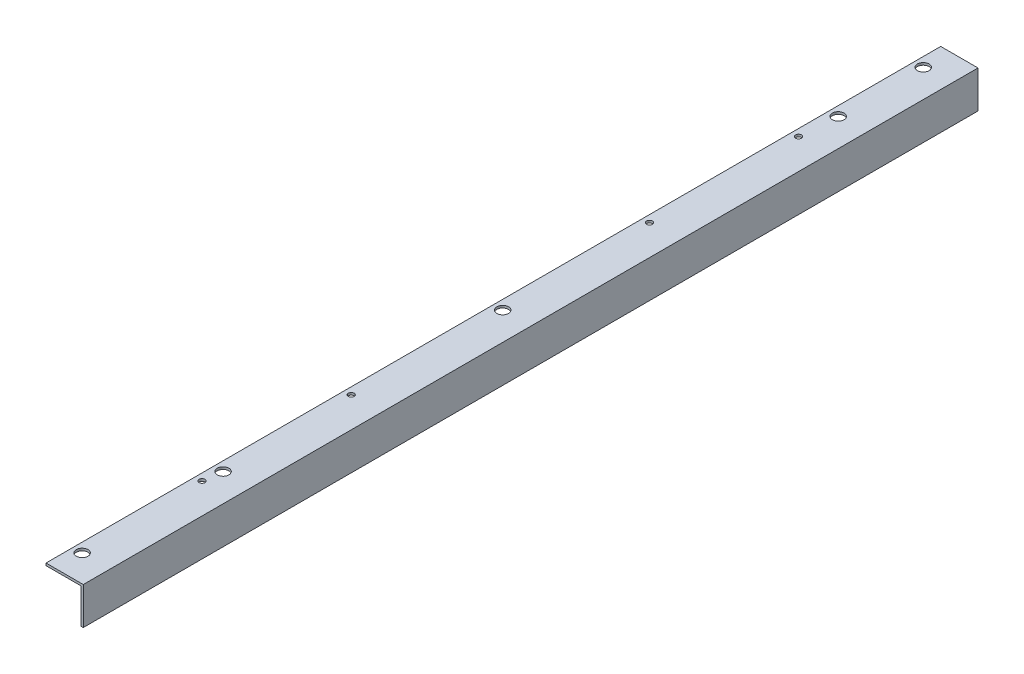
ISO-10303-21;
HEADER;
FILE_DESCRIPTION(('STEP AP214'),'2;1');
FILE_NAME('part.step','',(''),(''),'','','');
FILE_SCHEMA(('AUTOMOTIVE_DESIGN { 1 0 10303 214 1 1 1 1 }'));
ENDSEC;
DATA;
#1=APPLICATION_CONTEXT('core data for automotive mechanical design processes');
#2=APPLICATION_PROTOCOL_DEFINITION('international standard','automotive_design',2000,#1);
#3=PRODUCT_CONTEXT('',#1,'mechanical');
#4=PRODUCT('Part','Part','',(#3));
#5=PRODUCT_RELATED_PRODUCT_CATEGORY('part','',(#4));
#6=PRODUCT_DEFINITION_FORMATION('','',#4);
#7=PRODUCT_DEFINITION_CONTEXT('part definition',#1,'design');
#8=PRODUCT_DEFINITION('design','',#6,#7);
#9=PRODUCT_DEFINITION_SHAPE('','',#8);
#10=(LENGTH_UNIT() NAMED_UNIT(*) SI_UNIT(.MILLI.,.METRE.));
#11=(NAMED_UNIT(*) PLANE_ANGLE_UNIT() SI_UNIT($,.RADIAN.));
#12=(NAMED_UNIT(*) SI_UNIT($,.STERADIAN.) SOLID_ANGLE_UNIT());
#13=UNCERTAINTY_MEASURE_WITH_UNIT(LENGTH_MEASURE(1.E-05),#10,'distance_accuracy_value','');
#14=(GEOMETRIC_REPRESENTATION_CONTEXT(3) GLOBAL_UNCERTAINTY_ASSIGNED_CONTEXT((#13)) GLOBAL_UNIT_ASSIGNED_CONTEXT((#10,
#11,#12)) REPRESENTATION_CONTEXT('',''));
#15=CARTESIAN_POINT('',(0.,0.,0.));
#16=DIRECTION('',(0.,0.,1.));
#17=DIRECTION('',(1.,0.,0.));
#18=AXIS2_PLACEMENT_3D('',#15,#16,#17);
#19=CARTESIAN_POINT('',(0.,-50.8,1219.2));
#20=DIRECTION('',(-1.,0.,0.));
#21=DIRECTION('',(0.,0.,1.));
#22=AXIS2_PLACEMENT_3D('',#19,#20,#21);
#23=PLANE('',#22);
#24=DIRECTION('',(0.,1.,0.));
#25=VECTOR('',#24,1.);
#26=CARTESIAN_POINT('',(0.,-50.8,0.));
#27=LINE('',#26,#25);
#28=CARTESIAN_POINT('',(0.,-50.8,0.));
#29=VERTEX_POINT('',#28);
#30=CARTESIAN_POINT('',(0.,0.,0.));
#31=VERTEX_POINT('',#30);
#32=EDGE_CURVE('E118',#29,#31,#27,.T.);
#33=ORIENTED_EDGE('',*,*,#32,.T.);
#34=DIRECTION('',(0.,0.,-1.));
#35=VECTOR('',#34,1.);
#36=CARTESIAN_POINT('',(0.,0.,1219.2));
#37=LINE('',#36,#35);
#38=CARTESIAN_POINT('',(0.,0.,1219.2));
#39=VERTEX_POINT('',#38);
#40=EDGE_CURVE('E11',#39,#31,#37,.T.);
#41=ORIENTED_EDGE('',*,*,#40,.F.);
#42=DIRECTION('',(0.,1.,0.));
#43=VECTOR('',#42,1.);
#44=CARTESIAN_POINT('',(0.,-50.8,1219.2));
#45=LINE('',#44,#43);
#46=CARTESIAN_POINT('',(0.,-50.8,1219.2));
#47=VERTEX_POINT('',#46);
#48=EDGE_CURVE('E129',#47,#39,#45,.T.);
#49=ORIENTED_EDGE('',*,*,#48,.F.);
#50=DIRECTION('',(0.,0.,-1.));
#51=VECTOR('',#50,1.);
#52=CARTESIAN_POINT('',(0.,-50.8,1219.2));
#53=LINE('',#52,#51);
#54=EDGE_CURVE('E114',#47,#29,#53,.T.);
#55=ORIENTED_EDGE('',*,*,#54,.T.);
#56=EDGE_LOOP('',(#33,#41,#49,#55));
#57=FACE_BOUND('',#56,.T.);
#58=ADVANCED_FACE('F32',(#57),#23,.F.);
#59=CARTESIAN_POINT('',(0.,0.,1219.2));
#60=DIRECTION('',(0.,-1.,0.));
#61=DIRECTION('',(0.,0.,-1.));
#62=AXIS2_PLACEMENT_3D('',#59,#60,#61);
#63=PLANE('',#62);
#64=CARTESIAN_POINT('',(-41.275,0.,406.4));
#65=DIRECTION('',(0.,1.,0.));
#66=DIRECTION('',(0.,0.,1.));
#67=AXIS2_PLACEMENT_3D('',#64,#65,#66);
#68=CIRCLE('',#67,3.96874999999997);
#69=CARTESIAN_POINT('',(-41.275,0.,410.36875));
#70=VERTEX_POINT('',#69);
#71=EDGE_CURVE('E158',#70,#70,#68,.T.);
#72=ORIENTED_EDGE('',*,*,#71,.F.);
#73=EDGE_LOOP('',(#72));
#74=FACE_BOUND('',#73,.T.);
#75=CARTESIAN_POINT('',(-41.275,0.,812.8));
#76=DIRECTION('',(0.,1.,0.));
#77=DIRECTION('',(0.,0.,1.));
#78=AXIS2_PLACEMENT_3D('',#75,#76,#77);
#79=CIRCLE('',#78,3.96874999999997);
#80=CARTESIAN_POINT('',(-41.275,0.,816.76875));
#81=VERTEX_POINT('',#80);
#82=EDGE_CURVE('E279',#81,#81,#79,.T.);
#83=ORIENTED_EDGE('',*,*,#82,.F.);
#84=EDGE_LOOP('',(#83));
#85=FACE_BOUND('',#84,.T.);
#86=CARTESIAN_POINT('',(-41.275,0.,1016.));
#87=DIRECTION('',(0.,1.,0.));
#88=DIRECTION('',(0.,0.,1.));
#89=AXIS2_PLACEMENT_3D('',#86,#87,#88);
#90=CIRCLE('',#89,3.96874999999997);
#91=CARTESIAN_POINT('',(-41.275,0.,1019.96875));
#92=VERTEX_POINT('',#91);
#93=EDGE_CURVE('E171',#92,#92,#90,.T.);
#94=ORIENTED_EDGE('',*,*,#93,.F.);
#95=EDGE_LOOP('',(#94));
#96=FACE_BOUND('',#95,.T.);
#97=CARTESIAN_POINT('',(-41.275,0.,203.2));
#98=DIRECTION('',(0.,1.,0.));
#99=DIRECTION('',(0.,0.,1.));
#100=AXIS2_PLACEMENT_3D('',#97,#98,#99);
#101=CIRCLE('',#100,3.96874999999997);
#102=CARTESIAN_POINT('',(-41.275,0.,207.16875));
#103=VERTEX_POINT('',#102);
#104=EDGE_CURVE('E154',#103,#103,#101,.T.);
#105=ORIENTED_EDGE('',*,*,#104,.F.);
#106=EDGE_LOOP('',(#105));
#107=FACE_BOUND('',#106,.T.);
#108=CARTESIAN_POINT('',(-38.1,0.,36.5124999999999));
#109=DIRECTION('',(0.,1.,0.));
#110=DIRECTION('',(0.,0.,1.));
#111=AXIS2_PLACEMENT_3D('',#108,#109,#110);
#112=CIRCLE('',#111,7.9375);
#113=CARTESIAN_POINT('',(-38.1,0.,44.4499999999999));
#114=VERTEX_POINT('',#113);
#115=EDGE_CURVE('E139',#114,#114,#112,.T.);
#116=ORIENTED_EDGE('',*,*,#115,.F.);
#117=EDGE_LOOP('',(#116));
#118=FACE_BOUND('',#117,.T.);
#119=CARTESIAN_POINT('',(-38.1,0.,990.6));
#120=DIRECTION('',(0.,1.,0.));
#121=DIRECTION('',(0.,0.,1.));
#122=AXIS2_PLACEMENT_3D('',#119,#120,#121);
#123=CIRCLE('',#122,7.9375);
#124=CARTESIAN_POINT('',(-38.1,0.,998.5375));
#125=VERTEX_POINT('',#124);
#126=EDGE_CURVE('E153',#125,#125,#123,.T.);
#127=ORIENTED_EDGE('',*,*,#126,.F.);
#128=EDGE_LOOP('',(#127));
#129=FACE_BOUND('',#128,.T.);
#130=CARTESIAN_POINT('',(-38.1,0.,609.6));
#131=DIRECTION('',(0.,1.,0.));
#132=DIRECTION('',(0.,0.,1.));
#133=AXIS2_PLACEMENT_3D('',#130,#131,#132);
#134=CIRCLE('',#133,7.93750000000003);
#135=CARTESIAN_POINT('',(-38.1,0.,617.5375));
#136=VERTEX_POINT('',#135);
#137=EDGE_CURVE('E176',#136,#136,#134,.T.);
#138=ORIENTED_EDGE('',*,*,#137,.F.);
#139=EDGE_LOOP('',(#138));
#140=FACE_BOUND('',#139,.T.);
#141=CARTESIAN_POINT('',(-38.1,0.,152.4));
#142=DIRECTION('',(0.,1.,0.));
#143=DIRECTION('',(0.,0.,1.));
#144=AXIS2_PLACEMENT_3D('',#141,#142,#143);
#145=CIRCLE('',#144,7.9375);
#146=CARTESIAN_POINT('',(-38.1,0.,160.3375));
#147=VERTEX_POINT('',#146);
#148=EDGE_CURVE('E179',#147,#147,#145,.T.);
#149=ORIENTED_EDGE('',*,*,#148,.F.);
#150=EDGE_LOOP('',(#149));
#151=FACE_BOUND('',#150,.T.);
#152=CARTESIAN_POINT('',(-38.1,0.,1182.6875));
#153=DIRECTION('',(0.,1.,0.));
#154=DIRECTION('',(0.,0.,1.));
#155=AXIS2_PLACEMENT_3D('',#152,#153,#154);
#156=CIRCLE('',#155,7.93749999999997);
#157=CARTESIAN_POINT('',(-38.1,0.,1190.625));
#158=VERTEX_POINT('',#157);
#159=EDGE_CURVE('E175',#158,#158,#156,.T.);
#160=ORIENTED_EDGE('',*,*,#159,.F.);
#161=EDGE_LOOP('',(#160));
#162=FACE_BOUND('',#161,.T.);
#163=DIRECTION('',(-1.,0.,0.));
#164=VECTOR('',#163,1.);
#165=CARTESIAN_POINT('',(0.,0.,0.));
#166=LINE('',#165,#164);
#167=CARTESIAN_POINT('',(-50.8,0.,0.));
#168=VERTEX_POINT('',#167);
#169=EDGE_CURVE('E121',#31,#168,#166,.T.);
#170=ORIENTED_EDGE('',*,*,#169,.T.);
#171=DIRECTION('',(0.,0.,-1.));
#172=VECTOR('',#171,1.);
#173=CARTESIAN_POINT('',(-50.8,0.,1219.2));
#174=LINE('',#173,#172);
#175=CARTESIAN_POINT('',(-50.8,0.,1219.2));
#176=VERTEX_POINT('',#175);
#177=EDGE_CURVE('E41',#176,#168,#174,.T.);
#178=ORIENTED_EDGE('',*,*,#177,.F.);
#179=DIRECTION('',(-1.,0.,0.));
#180=VECTOR('',#179,1.);
#181=CARTESIAN_POINT('',(0.,0.,1219.2));
#182=LINE('',#181,#180);
#183=EDGE_CURVE('E87',#39,#176,#182,.T.);
#184=ORIENTED_EDGE('',*,*,#183,.F.);
#185=ORIENTED_EDGE('',*,*,#40,.T.);
#186=EDGE_LOOP('',(#170,#178,#184,#185));
#187=FACE_BOUND('',#186,.T.);
#188=ADVANCED_FACE('F189',(#74,#85,#96,#107,#118,#129,#140,#151,#162,#187),#63,.F.);
#189=CARTESIAN_POINT('',(-50.8,0.,1219.2));
#190=DIRECTION('',(1.,0.,0.));
#191=DIRECTION('',(0.,0.,-1.));
#192=AXIS2_PLACEMENT_3D('',#189,#190,#191);
#193=PLANE('',#192);
#194=DIRECTION('',(0.,-1.,0.));
#195=VECTOR('',#194,1.);
#196=CARTESIAN_POINT('',(-50.8,0.,0.));
#197=LINE('',#196,#195);
#198=CARTESIAN_POINT('',(-50.8,-3.17500000000001,0.));
#199=VERTEX_POINT('',#198);
#200=EDGE_CURVE('E124',#168,#199,#197,.T.);
#201=ORIENTED_EDGE('',*,*,#200,.T.);
#202=DIRECTION('',(0.,0.,-1.));
#203=VECTOR('',#202,1.);
#204=CARTESIAN_POINT('',(-50.8,-3.17500000000001,1219.2));
#205=LINE('',#204,#203);
#206=CARTESIAN_POINT('',(-50.8,-3.17500000000001,1219.2));
#207=VERTEX_POINT('',#206);
#208=EDGE_CURVE('E109',#207,#199,#205,.T.);
#209=ORIENTED_EDGE('',*,*,#208,.F.);
#210=DIRECTION('',(0.,-1.,0.));
#211=VECTOR('',#210,1.);
#212=CARTESIAN_POINT('',(-50.8,0.,1219.2));
#213=LINE('',#212,#211);
#214=EDGE_CURVE('E100',#176,#207,#213,.T.);
#215=ORIENTED_EDGE('',*,*,#214,.F.);
#216=ORIENTED_EDGE('',*,*,#177,.T.);
#217=EDGE_LOOP('',(#201,#209,#215,#216));
#218=FACE_BOUND('',#217,.T.);
#219=ADVANCED_FACE('F192',(#218),#193,.F.);
#220=CARTESIAN_POINT('',(-50.8,-3.17500000000001,1219.2));
#221=DIRECTION('',(0.,1.,0.));
#222=DIRECTION('',(0.,0.,1.));
#223=AXIS2_PLACEMENT_3D('',#220,#221,#222);
#224=PLANE('',#223);
#225=CARTESIAN_POINT('',(-41.275,-3.175,406.4));
#226=DIRECTION('',(0.,1.,0.));
#227=DIRECTION('',(0.,0.,1.));
#228=AXIS2_PLACEMENT_3D('',#225,#226,#227);
#229=CIRCLE('',#228,3.96874999999997);
#230=CARTESIAN_POINT('',(-41.275,-3.175,410.36875));
#231=VERTEX_POINT('',#230);
#232=EDGE_CURVE('E35',#231,#231,#229,.T.);
#233=ORIENTED_EDGE('',*,*,#232,.T.);
#234=EDGE_LOOP('',(#233));
#235=FACE_BOUND('',#234,.T.);
#236=CARTESIAN_POINT('',(-41.275,-3.175,812.8));
#237=DIRECTION('',(0.,1.,0.));
#238=DIRECTION('',(0.,0.,1.));
#239=AXIS2_PLACEMENT_3D('',#236,#237,#238);
#240=CIRCLE('',#239,3.96874999999997);
#241=CARTESIAN_POINT('',(-41.275,-3.175,816.76875));
#242=VERTEX_POINT('',#241);
#243=EDGE_CURVE('E157',#242,#242,#240,.T.);
#244=ORIENTED_EDGE('',*,*,#243,.T.);
#245=EDGE_LOOP('',(#244));
#246=FACE_BOUND('',#245,.T.);
#247=CARTESIAN_POINT('',(-41.275,-3.175,1016.));
#248=DIRECTION('',(0.,1.,0.));
#249=DIRECTION('',(0.,0.,1.));
#250=AXIS2_PLACEMENT_3D('',#247,#248,#249);
#251=CIRCLE('',#250,3.96874999999997);
#252=CARTESIAN_POINT('',(-41.275,-3.175,1019.96875));
#253=VERTEX_POINT('',#252);
#254=EDGE_CURVE('E155',#253,#253,#251,.T.);
#255=ORIENTED_EDGE('',*,*,#254,.T.);
#256=EDGE_LOOP('',(#255));
#257=FACE_BOUND('',#256,.T.);
#258=CARTESIAN_POINT('',(-41.275,-3.175,203.2));
#259=DIRECTION('',(0.,1.,0.));
#260=DIRECTION('',(0.,0.,1.));
#261=AXIS2_PLACEMENT_3D('',#258,#259,#260);
#262=CIRCLE('',#261,3.96874999999997);
#263=CARTESIAN_POINT('',(-41.275,-3.175,207.16875));
#264=VERTEX_POINT('',#263);
#265=EDGE_CURVE('E150',#264,#264,#262,.T.);
#266=ORIENTED_EDGE('',*,*,#265,.T.);
#267=EDGE_LOOP('',(#266));
#268=FACE_BOUND('',#267,.T.);
#269=CARTESIAN_POINT('',(-38.1,-3.175,36.5124999999999));
#270=DIRECTION('',(0.,1.,0.));
#271=DIRECTION('',(0.,0.,1.));
#272=AXIS2_PLACEMENT_3D('',#269,#270,#271);
#273=CIRCLE('',#272,7.9375);
#274=CARTESIAN_POINT('',(-38.1,-3.175,44.4499999999999));
#275=VERTEX_POINT('',#274);
#276=EDGE_CURVE('E122',#275,#275,#273,.T.);
#277=ORIENTED_EDGE('',*,*,#276,.T.);
#278=EDGE_LOOP('',(#277));
#279=FACE_BOUND('',#278,.T.);
#280=CARTESIAN_POINT('',(-38.1,-3.175,990.6));
#281=DIRECTION('',(0.,1.,0.));
#282=DIRECTION('',(0.,0.,1.));
#283=AXIS2_PLACEMENT_3D('',#280,#281,#282);
#284=CIRCLE('',#283,7.9375);
#285=CARTESIAN_POINT('',(-38.1,-3.175,998.5375));
#286=VERTEX_POINT('',#285);
#287=EDGE_CURVE('E145',#286,#286,#284,.T.);
#288=ORIENTED_EDGE('',*,*,#287,.T.);
#289=EDGE_LOOP('',(#288));
#290=FACE_BOUND('',#289,.T.);
#291=CARTESIAN_POINT('',(-38.1,-3.175,609.6));
#292=DIRECTION('',(0.,1.,0.));
#293=DIRECTION('',(0.,0.,1.));
#294=AXIS2_PLACEMENT_3D('',#291,#292,#293);
#295=CIRCLE('',#294,7.93750000000003);
#296=CARTESIAN_POINT('',(-38.1,-3.175,617.5375));
#297=VERTEX_POINT('',#296);
#298=EDGE_CURVE('E142',#297,#297,#295,.T.);
#299=ORIENTED_EDGE('',*,*,#298,.T.);
#300=EDGE_LOOP('',(#299));
#301=FACE_BOUND('',#300,.T.);
#302=CARTESIAN_POINT('',(-38.1,-3.175,152.4));
#303=DIRECTION('',(0.,1.,0.));
#304=DIRECTION('',(0.,0.,1.));
#305=AXIS2_PLACEMENT_3D('',#302,#303,#304);
#306=CIRCLE('',#305,7.9375);
#307=CARTESIAN_POINT('',(-38.1,-3.175,160.3375));
#308=VERTEX_POINT('',#307);
#309=EDGE_CURVE('E138',#308,#308,#306,.T.);
#310=ORIENTED_EDGE('',*,*,#309,.T.);
#311=EDGE_LOOP('',(#310));
#312=FACE_BOUND('',#311,.T.);
#313=CARTESIAN_POINT('',(-38.1,-3.175,1182.6875));
#314=DIRECTION('',(0.,1.,0.));
#315=DIRECTION('',(0.,0.,1.));
#316=AXIS2_PLACEMENT_3D('',#313,#314,#315);
#317=CIRCLE('',#316,7.93749999999997);
#318=CARTESIAN_POINT('',(-38.1,-3.175,1190.625));
#319=VERTEX_POINT('',#318);
#320=EDGE_CURVE('E135',#319,#319,#317,.T.);
#321=ORIENTED_EDGE('',*,*,#320,.T.);
#322=EDGE_LOOP('',(#321));
#323=FACE_BOUND('',#322,.T.);
#324=DIRECTION('',(1.,0.,0.));
#325=VECTOR('',#324,1.);
#326=CARTESIAN_POINT('',(-50.8,-3.17500000000001,0.));
#327=LINE('',#326,#325);
#328=CARTESIAN_POINT('',(-3.17500000000001,-3.17500000000001,0.));
#329=VERTEX_POINT('',#328);
#330=EDGE_CURVE('E108',#199,#329,#327,.T.);
#331=ORIENTED_EDGE('',*,*,#330,.T.);
#332=DIRECTION('',(0.,0.,-1.));
#333=VECTOR('',#332,1.);
#334=CARTESIAN_POINT('',(-3.17500000000001,-3.17500000000001,1219.2));
#335=LINE('',#334,#333);
#336=CARTESIAN_POINT('',(-3.17500000000001,-3.17500000000001,1219.2));
#337=VERTEX_POINT('',#336);
#338=EDGE_CURVE('E105',#337,#329,#335,.T.);
#339=ORIENTED_EDGE('',*,*,#338,.F.);
#340=DIRECTION('',(1.,0.,0.));
#341=VECTOR('',#340,1.);
#342=CARTESIAN_POINT('',(-50.8,-3.17500000000001,1219.2));
#343=LINE('',#342,#341);
#344=EDGE_CURVE('E94',#207,#337,#343,.T.);
#345=ORIENTED_EDGE('',*,*,#344,.F.);
#346=ORIENTED_EDGE('',*,*,#208,.T.);
#347=EDGE_LOOP('',(#331,#339,#345,#346));
#348=FACE_BOUND('',#347,.T.);
#349=ADVANCED_FACE('F106',(#235,#246,#257,#268,#279,#290,#301,#312,#323,#348),#224,.F.);
#350=CARTESIAN_POINT('',(-3.17500000000001,-3.17500000000001,1219.2));
#351=DIRECTION('',(1.,0.,0.));
#352=DIRECTION('',(0.,1.,0.));
#353=AXIS2_PLACEMENT_3D('',#350,#351,#352);
#354=PLANE('',#353);
#355=DIRECTION('',(0.,-1.,0.));
#356=VECTOR('',#355,1.);
#357=CARTESIAN_POINT('',(-3.17500000000001,-3.17500000000001,0.));
#358=LINE('',#357,#356);
#359=CARTESIAN_POINT('',(-3.175,-50.8,0.));
#360=VERTEX_POINT('',#359);
#361=EDGE_CURVE('E73',#329,#360,#358,.T.);
#362=ORIENTED_EDGE('',*,*,#361,.T.);
#363=DIRECTION('',(0.,0.,-1.));
#364=VECTOR('',#363,1.);
#365=CARTESIAN_POINT('',(-3.175,-50.8,1219.2));
#366=LINE('',#365,#364);
#367=CARTESIAN_POINT('',(-3.175,-50.8,1219.2));
#368=VERTEX_POINT('',#367);
#369=EDGE_CURVE('E110',#368,#360,#366,.T.);
#370=ORIENTED_EDGE('',*,*,#369,.F.);
#371=DIRECTION('',(0.,-1.,0.));
#372=VECTOR('',#371,1.);
#373=CARTESIAN_POINT('',(-3.17500000000001,-3.17500000000001,1219.2));
#374=LINE('',#373,#372);
#375=EDGE_CURVE('E98',#337,#368,#374,.T.);
#376=ORIENTED_EDGE('',*,*,#375,.F.);
#377=ORIENTED_EDGE('',*,*,#338,.T.);
#378=EDGE_LOOP('',(#362,#370,#376,#377));
#379=FACE_BOUND('',#378,.T.);
#380=ADVANCED_FACE('F112',(#379),#354,.F.);
#381=CARTESIAN_POINT('',(-3.175,-50.8,1219.2));
#382=DIRECTION('',(0.,1.,0.));
#383=DIRECTION('',(0.,0.,1.));
#384=AXIS2_PLACEMENT_3D('',#381,#382,#383);
#385=PLANE('',#384);
#386=DIRECTION('',(1.,0.,0.));
#387=VECTOR('',#386,1.);
#388=CARTESIAN_POINT('',(-3.175,-50.8,0.));
#389=LINE('',#388,#387);
#390=EDGE_CURVE('E79',#360,#29,#389,.T.);
#391=ORIENTED_EDGE('',*,*,#390,.T.);
#392=ORIENTED_EDGE('',*,*,#54,.F.);
#393=DIRECTION('',(1.,0.,0.));
#394=VECTOR('',#393,1.);
#395=CARTESIAN_POINT('',(-3.175,-50.8,1219.2));
#396=LINE('',#395,#394);
#397=EDGE_CURVE('E50',#368,#47,#396,.T.);
#398=ORIENTED_EDGE('',*,*,#397,.F.);
#399=ORIENTED_EDGE('',*,*,#369,.T.);
#400=EDGE_LOOP('',(#391,#392,#398,#399));
#401=FACE_BOUND('',#400,.T.);
#402=ADVANCED_FACE('F197',(#401),#385,.F.);
#403=CARTESIAN_POINT('',(0.,0.,1219.2));
#404=DIRECTION('',(0.,0.,1.));
#405=DIRECTION('',(1.,0.,0.));
#406=AXIS2_PLACEMENT_3D('',#403,#404,#405);
#407=PLANE('',#406);
#408=ORIENTED_EDGE('',*,*,#48,.T.);
#409=ORIENTED_EDGE('',*,*,#183,.T.);
#410=ORIENTED_EDGE('',*,*,#214,.T.);
#411=ORIENTED_EDGE('',*,*,#344,.T.);
#412=ORIENTED_EDGE('',*,*,#375,.T.);
#413=ORIENTED_EDGE('',*,*,#397,.T.);
#414=EDGE_LOOP('',(#408,#409,#410,#411,#412,#413));
#415=FACE_BOUND('',#414,.T.);
#416=ADVANCED_FACE('F96',(#415),#407,.T.);
#417=CARTESIAN_POINT('',(0.,0.,0.));
#418=DIRECTION('',(0.,0.,1.));
#419=DIRECTION('',(1.,0.,0.));
#420=AXIS2_PLACEMENT_3D('',#417,#418,#419);
#421=PLANE('',#420);
#422=ORIENTED_EDGE('',*,*,#32,.F.);
#423=ORIENTED_EDGE('',*,*,#390,.F.);
#424=ORIENTED_EDGE('',*,*,#361,.F.);
#425=ORIENTED_EDGE('',*,*,#330,.F.);
#426=ORIENTED_EDGE('',*,*,#200,.F.);
#427=ORIENTED_EDGE('',*,*,#169,.F.);
#428=EDGE_LOOP('',(#422,#423,#424,#425,#426,#427));
#429=FACE_BOUND('',#428,.T.);
#430=ADVANCED_FACE('F195',(#429),#421,.F.);
#431=CARTESIAN_POINT('',(-38.1,-50.8,1182.6875));
#432=DIRECTION('',(0.,1.,0.));
#433=DIRECTION('',(0.,0.,1.));
#434=AXIS2_PLACEMENT_3D('',#431,#432,#433);
#435=CYLINDRICAL_SURFACE('',#434,7.93749999999997);
#436=ORIENTED_EDGE('',*,*,#159,.T.);
#437=EDGE_LOOP('',(#436));
#438=FACE_BOUND('',#437,.T.);
#439=ORIENTED_EDGE('',*,*,#320,.F.);
#440=EDGE_LOOP('',(#439));
#441=FACE_BOUND('',#440,.T.);
#442=ADVANCED_FACE('F237',(#438,#441),#435,.F.);
#443=CARTESIAN_POINT('',(-38.1,-50.8,152.4));
#444=DIRECTION('',(0.,1.,0.));
#445=DIRECTION('',(0.,0.,1.));
#446=AXIS2_PLACEMENT_3D('',#443,#444,#445);
#447=CYLINDRICAL_SURFACE('',#446,7.9375);
#448=ORIENTED_EDGE('',*,*,#148,.T.);
#449=EDGE_LOOP('',(#448));
#450=FACE_BOUND('',#449,.T.);
#451=ORIENTED_EDGE('',*,*,#309,.F.);
#452=EDGE_LOOP('',(#451));
#453=FACE_BOUND('',#452,.T.);
#454=ADVANCED_FACE('F239',(#450,#453),#447,.F.);
#455=CARTESIAN_POINT('',(-38.1,-50.8,609.6));
#456=DIRECTION('',(0.,1.,0.));
#457=DIRECTION('',(0.,0.,1.));
#458=AXIS2_PLACEMENT_3D('',#455,#456,#457);
#459=CYLINDRICAL_SURFACE('',#458,7.93750000000003);
#460=ORIENTED_EDGE('',*,*,#137,.T.);
#461=EDGE_LOOP('',(#460));
#462=FACE_BOUND('',#461,.T.);
#463=ORIENTED_EDGE('',*,*,#298,.F.);
#464=EDGE_LOOP('',(#463));
#465=FACE_BOUND('',#464,.T.);
#466=ADVANCED_FACE('F246',(#462,#465),#459,.F.);
#467=CARTESIAN_POINT('',(-38.1,-50.8,990.6));
#468=DIRECTION('',(0.,1.,0.));
#469=DIRECTION('',(0.,0.,1.));
#470=AXIS2_PLACEMENT_3D('',#467,#468,#469);
#471=CYLINDRICAL_SURFACE('',#470,7.9375);
#472=ORIENTED_EDGE('',*,*,#126,.T.);
#473=EDGE_LOOP('',(#472));
#474=FACE_BOUND('',#473,.T.);
#475=ORIENTED_EDGE('',*,*,#287,.F.);
#476=EDGE_LOOP('',(#475));
#477=FACE_BOUND('',#476,.T.);
#478=ADVANCED_FACE('F250',(#474,#477),#471,.F.);
#479=CARTESIAN_POINT('',(-38.1,-50.8,36.5124999999999));
#480=DIRECTION('',(0.,1.,0.));
#481=DIRECTION('',(0.,0.,1.));
#482=AXIS2_PLACEMENT_3D('',#479,#480,#481);
#483=CYLINDRICAL_SURFACE('',#482,7.9375);
#484=ORIENTED_EDGE('',*,*,#115,.T.);
#485=EDGE_LOOP('',(#484));
#486=FACE_BOUND('',#485,.T.);
#487=ORIENTED_EDGE('',*,*,#276,.F.);
#488=EDGE_LOOP('',(#487));
#489=FACE_BOUND('',#488,.T.);
#490=ADVANCED_FACE('F253',(#486,#489),#483,.F.);
#491=CARTESIAN_POINT('',(-41.275,-44.45,203.2));
#492=DIRECTION('',(0.,1.,0.));
#493=DIRECTION('',(0.,0.,1.));
#494=AXIS2_PLACEMENT_3D('',#491,#492,#493);
#495=CYLINDRICAL_SURFACE('',#494,3.96874999999997);
#496=ORIENTED_EDGE('',*,*,#104,.T.);
#497=EDGE_LOOP('',(#496));
#498=FACE_BOUND('',#497,.T.);
#499=ORIENTED_EDGE('',*,*,#265,.F.);
#500=EDGE_LOOP('',(#499));
#501=FACE_BOUND('',#500,.T.);
#502=ADVANCED_FACE('F260',(#498,#501),#495,.F.);
#503=CARTESIAN_POINT('',(-41.275,-44.45,1016.));
#504=DIRECTION('',(0.,1.,0.));
#505=DIRECTION('',(0.,0.,1.));
#506=AXIS2_PLACEMENT_3D('',#503,#504,#505);
#507=CYLINDRICAL_SURFACE('',#506,3.96874999999997);
#508=ORIENTED_EDGE('',*,*,#93,.T.);
#509=EDGE_LOOP('',(#508));
#510=FACE_BOUND('',#509,.T.);
#511=ORIENTED_EDGE('',*,*,#254,.F.);
#512=EDGE_LOOP('',(#511));
#513=FACE_BOUND('',#512,.T.);
#514=ADVANCED_FACE('F264',(#510,#513),#507,.F.);
#515=CARTESIAN_POINT('',(-41.275,-44.45,812.8));
#516=DIRECTION('',(0.,1.,0.));
#517=DIRECTION('',(0.,0.,1.));
#518=AXIS2_PLACEMENT_3D('',#515,#516,#517);
#519=CYLINDRICAL_SURFACE('',#518,3.96874999999997);
#520=ORIENTED_EDGE('',*,*,#82,.T.);
#521=EDGE_LOOP('',(#520));
#522=FACE_BOUND('',#521,.T.);
#523=ORIENTED_EDGE('',*,*,#243,.F.);
#524=EDGE_LOOP('',(#523));
#525=FACE_BOUND('',#524,.T.);
#526=ADVANCED_FACE('F267',(#522,#525),#519,.F.);
#527=CARTESIAN_POINT('',(-41.275,-44.45,406.4));
#528=DIRECTION('',(0.,1.,0.));
#529=DIRECTION('',(0.,0.,1.));
#530=AXIS2_PLACEMENT_3D('',#527,#528,#529);
#531=CYLINDRICAL_SURFACE('',#530,3.96874999999997);
#532=ORIENTED_EDGE('',*,*,#71,.T.);
#533=EDGE_LOOP('',(#532));
#534=FACE_BOUND('',#533,.T.);
#535=ORIENTED_EDGE('',*,*,#232,.F.);
#536=EDGE_LOOP('',(#535));
#537=FACE_BOUND('',#536,.T.);
#538=ADVANCED_FACE('F271',(#534,#537),#531,.F.);
#539=CLOSED_SHELL('',(#58,#188,#219,#349,#380,#402,#416,#430,#442,#454,#466,#478,#490,#502,#514,
#526,#538));
#540=MANIFOLD_SOLID_BREP('B2',#539);
#541=ADVANCED_BREP_SHAPE_REPRESENTATION('',(#18,#540),#14);
#542=SHAPE_DEFINITION_REPRESENTATION(#9,#541);
ENDSEC;
END-ISO-10303-21;
